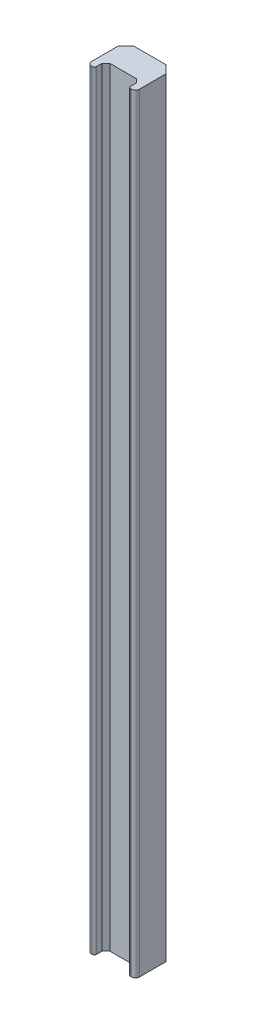
ISO-10303-21;
HEADER;
FILE_DESCRIPTION(('STEP AP214'),'2;1');
FILE_NAME('part.step','',(''),(''),'','','');
FILE_SCHEMA(('AUTOMOTIVE_DESIGN { 1 0 10303 214 1 1 1 1 }'));
ENDSEC;
DATA;
#1=APPLICATION_CONTEXT('core data for automotive mechanical design processes');
#2=APPLICATION_PROTOCOL_DEFINITION('international standard','automotive_design',2000,#1);
#3=PRODUCT_CONTEXT('',#1,'mechanical');
#4=PRODUCT('Part','Part','',(#3));
#5=PRODUCT_RELATED_PRODUCT_CATEGORY('part','',(#4));
#6=PRODUCT_DEFINITION_FORMATION('','',#4);
#7=PRODUCT_DEFINITION_CONTEXT('part definition',#1,'design');
#8=PRODUCT_DEFINITION('design','',#6,#7);
#9=PRODUCT_DEFINITION_SHAPE('','',#8);
#10=(LENGTH_UNIT() NAMED_UNIT(*) SI_UNIT(.MILLI.,.METRE.));
#11=(NAMED_UNIT(*) PLANE_ANGLE_UNIT() SI_UNIT($,.RADIAN.));
#12=(NAMED_UNIT(*) SI_UNIT($,.STERADIAN.) SOLID_ANGLE_UNIT());
#13=UNCERTAINTY_MEASURE_WITH_UNIT(LENGTH_MEASURE(1.E-05),#10,'distance_accuracy_value','');
#14=(GEOMETRIC_REPRESENTATION_CONTEXT(3) GLOBAL_UNCERTAINTY_ASSIGNED_CONTEXT((#13)) GLOBAL_UNIT_ASSIGNED_CONTEXT((#10,
#11,#12)) REPRESENTATION_CONTEXT('',''));
#15=CARTESIAN_POINT('',(0.,0.,0.));
#16=DIRECTION('',(0.,0.,1.));
#17=DIRECTION('',(1.,0.,0.));
#18=AXIS2_PLACEMENT_3D('',#15,#16,#17);
#19=CARTESIAN_POINT('',(1.,200.,0.));
#20=DIRECTION('',(0.,0.,-1.));
#21=DIRECTION('',(-1.,0.,0.));
#22=AXIS2_PLACEMENT_3D('',#19,#20,#21);
#23=PLANE('',#22);
#24=DIRECTION('',(1.,0.,0.));
#25=VECTOR('',#24,1.);
#26=CARTESIAN_POINT('',(1.,200.,0.));
#27=LINE('',#26,#25);
#28=CARTESIAN_POINT('',(11.19,200.,0.));
#29=VERTEX_POINT('',#28);
#30=CARTESIAN_POINT('',(11.48,200.,0.));
#31=VERTEX_POINT('',#30);
#32=EDGE_CURVE('E303',#29,#31,#27,.T.);
#33=ORIENTED_EDGE('',*,*,#32,.F.);
#34=DIRECTION('',(0.,-1.,0.));
#35=VECTOR('',#34,1.);
#36=CARTESIAN_POINT('',(11.19,200.,0.));
#37=LINE('',#36,#35);
#38=CARTESIAN_POINT('',(11.19,0.,0.));
#39=VERTEX_POINT('',#38);
#40=EDGE_CURVE('E370',#29,#39,#37,.T.);
#41=ORIENTED_EDGE('',*,*,#40,.T.);
#42=DIRECTION('',(1.,0.,0.));
#43=VECTOR('',#42,1.);
#44=CARTESIAN_POINT('',(1.,0.,0.));
#45=LINE('',#44,#43);
#46=CARTESIAN_POINT('',(11.48,0.,0.));
#47=VERTEX_POINT('',#46);
#48=EDGE_CURVE('E325',#39,#47,#45,.T.);
#49=ORIENTED_EDGE('',*,*,#48,.T.);
#50=DIRECTION('',(0.,-1.,0.));
#51=VECTOR('',#50,1.);
#52=CARTESIAN_POINT('',(11.48,200.,0.));
#53=LINE('',#52,#51);
#54=EDGE_CURVE('E306',#31,#47,#53,.T.);
#55=ORIENTED_EDGE('',*,*,#54,.F.);
#56=EDGE_LOOP('',(#33,#41,#49,#55));
#57=FACE_BOUND('',#56,.T.);
#58=ADVANCED_FACE('F38',(#57),#23,.F.);
#59=CARTESIAN_POINT('',(10.48,200.,-10.));
#60=DIRECTION('',(-0.707106781186547,0.,0.707106781186547));
#61=DIRECTION('',(0.707106781186548,0.,0.707106781186548));
#62=AXIS2_PLACEMENT_3D('',#59,#60,#61);
#63=PLANE('',#62);
#64=DIRECTION('',(0.,-1.,0.));
#65=VECTOR('',#64,1.);
#66=CARTESIAN_POINT('',(12.48,200.,-8.));
#67=LINE('',#66,#65);
#68=CARTESIAN_POINT('',(12.48,200.,-8.));
#69=VERTEX_POINT('',#68);
#70=CARTESIAN_POINT('',(12.48,175.,-8.));
#71=VERTEX_POINT('',#70);
#72=EDGE_CURVE('E351',#69,#71,#67,.T.);
#73=ORIENTED_EDGE('',*,*,#72,.T.);
#74=DIRECTION('',(-0.707106781186548,0.,-0.707106781186548));
#75=VECTOR('',#74,1.);
#76=CARTESIAN_POINT('',(10.48,175.,-10.));
#77=LINE('',#76,#75);
#78=CARTESIAN_POINT('',(10.48,175.,-10.));
#79=VERTEX_POINT('',#78);
#80=EDGE_CURVE('E283',#71,#79,#77,.T.);
#81=ORIENTED_EDGE('',*,*,#80,.T.);
#82=DIRECTION('',(0.,-1.,0.));
#83=VECTOR('',#82,1.);
#84=CARTESIAN_POINT('',(10.48,200.,-10.));
#85=LINE('',#84,#83);
#86=CARTESIAN_POINT('',(10.48,200.,-10.));
#87=VERTEX_POINT('',#86);
#88=EDGE_CURVE('E346',#87,#79,#85,.T.);
#89=ORIENTED_EDGE('',*,*,#88,.F.);
#90=DIRECTION('',(-0.707106781186547,0.,-0.707106781186547));
#91=VECTOR('',#90,1.);
#92=CARTESIAN_POINT('',(10.48,200.,-10.));
#93=LINE('',#92,#91);
#94=EDGE_CURVE('E293',#69,#87,#93,.T.);
#95=ORIENTED_EDGE('',*,*,#94,.F.);
#96=EDGE_LOOP('',(#73,#81,#89,#95));
#97=FACE_BOUND('',#96,.T.);
#98=ADVANCED_FACE('F418',(#97),#63,.F.);
#99=CARTESIAN_POINT('',(10.48,169.,-10.));
#100=VERTEX_POINT('',#99);
#101=CARTESIAN_POINT('',(10.48,31.,-10.));
#102=VERTEX_POINT('',#101);
#103=EDGE_CURVE('E350',#100,#102,#85,.T.);
#104=ORIENTED_EDGE('',*,*,#103,.F.);
#105=DIRECTION('',(0.707106781186548,0.,0.707106781186548));
#106=VECTOR('',#105,1.);
#107=CARTESIAN_POINT('',(10.48,169.,-10.));
#108=LINE('',#107,#106);
#109=CARTESIAN_POINT('',(12.48,169.,-8.));
#110=VERTEX_POINT('',#109);
#111=EDGE_CURVE('E280',#100,#110,#108,.T.);
#112=ORIENTED_EDGE('',*,*,#111,.T.);
#113=CARTESIAN_POINT('',(12.48,31.,-8.));
#114=VERTEX_POINT('',#113);
#115=EDGE_CURVE('E355',#110,#114,#67,.T.);
#116=ORIENTED_EDGE('',*,*,#115,.T.);
#117=DIRECTION('',(-0.707106781186548,0.,-0.707106781186548));
#118=VECTOR('',#117,1.);
#119=CARTESIAN_POINT('',(10.48,31.,-10.));
#120=LINE('',#119,#118);
#121=EDGE_CURVE('E277',#114,#102,#120,.T.);
#122=ORIENTED_EDGE('',*,*,#121,.T.);
#123=EDGE_LOOP('',(#104,#112,#116,#122));
#124=FACE_BOUND('',#123,.T.);
#125=ADVANCED_FACE('F449',(#124),#63,.F.);
#126=CARTESIAN_POINT('',(2.,200.,-10.));
#127=DIRECTION('',(0.,0.,1.));
#128=DIRECTION('',(1.,0.,0.));
#129=AXIS2_PLACEMENT_3D('',#126,#127,#128);
#130=PLANE('',#129);
#131=ORIENTED_EDGE('',*,*,#88,.T.);
#132=DIRECTION('',(1.,0.,0.));
#133=VECTOR('',#132,1.);
#134=CARTESIAN_POINT('',(12.48,175.,-10.));
#135=LINE('',#134,#133);
#136=CARTESIAN_POINT('',(2.,175.,-10.));
#137=VERTEX_POINT('',#136);
#138=EDGE_CURVE('E251',#137,#79,#135,.T.);
#139=ORIENTED_EDGE('',*,*,#138,.F.);
#140=DIRECTION('',(0.,-1.,0.));
#141=VECTOR('',#140,1.);
#142=CARTESIAN_POINT('',(2.,200.,-10.));
#143=LINE('',#142,#141);
#144=CARTESIAN_POINT('',(2.,200.,-10.));
#145=VERTEX_POINT('',#144);
#146=EDGE_CURVE('E341',#145,#137,#143,.T.);
#147=ORIENTED_EDGE('',*,*,#146,.F.);
#148=DIRECTION('',(-1.,0.,0.));
#149=VECTOR('',#148,1.);
#150=CARTESIAN_POINT('',(2.,200.,-10.));
#151=LINE('',#150,#149);
#152=EDGE_CURVE('E295',#87,#145,#151,.T.);
#153=ORIENTED_EDGE('',*,*,#152,.F.);
#154=EDGE_LOOP('',(#131,#139,#147,#153));
#155=FACE_BOUND('',#154,.T.);
#156=ADVANCED_FACE('F423',(#155),#130,.F.);
#157=CARTESIAN_POINT('',(2.,169.,-10.));
#158=VERTEX_POINT('',#157);
#159=CARTESIAN_POINT('',(2.,31.,-10.));
#160=VERTEX_POINT('',#159);
#161=EDGE_CURVE('E345',#158,#160,#143,.T.);
#162=ORIENTED_EDGE('',*,*,#161,.F.);
#163=DIRECTION('',(-1.,0.,0.));
#164=VECTOR('',#163,1.);
#165=CARTESIAN_POINT('',(12.48,169.,-10.));
#166=LINE('',#165,#164);
#167=EDGE_CURVE('E259',#100,#158,#166,.T.);
#168=ORIENTED_EDGE('',*,*,#167,.F.);
#169=ORIENTED_EDGE('',*,*,#103,.T.);
#170=DIRECTION('',(1.,0.,0.));
#171=VECTOR('',#170,1.);
#172=CARTESIAN_POINT('',(12.48,31.,-10.));
#173=LINE('',#172,#171);
#174=EDGE_CURVE('E267',#160,#102,#173,.T.);
#175=ORIENTED_EDGE('',*,*,#174,.F.);
#176=EDGE_LOOP('',(#162,#168,#169,#175));
#177=FACE_BOUND('',#176,.T.);
#178=ADVANCED_FACE('F486',(#177),#130,.F.);
#179=CARTESIAN_POINT('',(0.,200.,-8.));
#180=DIRECTION('',(0.707106781186548,0.,0.707106781186547));
#181=DIRECTION('',(0.707106781186547,0.,-0.707106781186548));
#182=AXIS2_PLACEMENT_3D('',#179,#180,#181);
#183=PLANE('',#182);
#184=ORIENTED_EDGE('',*,*,#146,.T.);
#185=DIRECTION('',(-0.707106781186547,0.,0.707106781186548));
#186=VECTOR('',#185,1.);
#187=CARTESIAN_POINT('',(0.,175.,-8.));
#188=LINE('',#187,#186);
#189=CARTESIAN_POINT('',(0.,175.,-8.));
#190=VERTEX_POINT('',#189);
#191=EDGE_CURVE('E367',#137,#190,#188,.T.);
#192=ORIENTED_EDGE('',*,*,#191,.T.);
#193=DIRECTION('',(0.,-1.,0.));
#194=VECTOR('',#193,1.);
#195=CARTESIAN_POINT('',(0.,200.,-8.));
#196=LINE('',#195,#194);
#197=CARTESIAN_POINT('',(0.,200.,-8.));
#198=VERTEX_POINT('',#197);
#199=EDGE_CURVE('E336',#198,#190,#196,.T.);
#200=ORIENTED_EDGE('',*,*,#199,.F.);
#201=DIRECTION('',(-0.707106781186547,0.,0.707106781186548));
#202=VECTOR('',#201,1.);
#203=CARTESIAN_POINT('',(0.,200.,-8.));
#204=LINE('',#203,#202);
#205=EDGE_CURVE('E297',#145,#198,#204,.T.);
#206=ORIENTED_EDGE('',*,*,#205,.F.);
#207=EDGE_LOOP('',(#184,#192,#200,#206));
#208=FACE_BOUND('',#207,.T.);
#209=ADVANCED_FACE('F429',(#208),#183,.F.);
#210=CARTESIAN_POINT('',(0.,169.,-8.));
#211=VERTEX_POINT('',#210);
#212=CARTESIAN_POINT('',(0.,31.,-8.));
#213=VERTEX_POINT('',#212);
#214=EDGE_CURVE('E340',#211,#213,#196,.T.);
#215=ORIENTED_EDGE('',*,*,#214,.F.);
#216=DIRECTION('',(0.707106781186547,0.,-0.707106781186548));
#217=VECTOR('',#216,1.);
#218=CARTESIAN_POINT('',(0.,169.,-8.));
#219=LINE('',#218,#217);
#220=EDGE_CURVE('E364',#211,#158,#219,.T.);
#221=ORIENTED_EDGE('',*,*,#220,.T.);
#222=ORIENTED_EDGE('',*,*,#161,.T.);
#223=DIRECTION('',(-0.707106781186547,0.,0.707106781186548));
#224=VECTOR('',#223,1.);
#225=CARTESIAN_POINT('',(0.,31.,-8.));
#226=LINE('',#225,#224);
#227=EDGE_CURVE('E361',#160,#213,#226,.T.);
#228=ORIENTED_EDGE('',*,*,#227,.T.);
#229=EDGE_LOOP('',(#215,#221,#222,#228));
#230=FACE_BOUND('',#229,.T.);
#231=ADVANCED_FACE('F491',(#230),#183,.F.);
#232=CARTESIAN_POINT('',(11.48,200.,-1.));
#233=DIRECTION('',(0.,-1.,0.));
#234=DIRECTION('',(0.,0.,-1.));
#235=AXIS2_PLACEMENT_3D('',#232,#233,#234);
#236=CYLINDRICAL_SURFACE('',#235,1.);
#237=CARTESIAN_POINT('',(11.48,0.,-1.));
#238=DIRECTION('',(0.,1.,0.));
#239=DIRECTION('',(0.,0.,1.));
#240=AXIS2_PLACEMENT_3D('',#237,#238,#239);
#241=CIRCLE('',#240,1.);
#242=CARTESIAN_POINT('',(12.48,0.,-1.));
#243=VERTEX_POINT('',#242);
#244=EDGE_CURVE('E286',#47,#243,#241,.T.);
#245=ORIENTED_EDGE('',*,*,#244,.T.);
#246=DIRECTION('',(0.,-1.,0.));
#247=VECTOR('',#246,1.);
#248=CARTESIAN_POINT('',(12.48,200.,-1.));
#249=LINE('',#248,#247);
#250=CARTESIAN_POINT('',(12.48,200.,-1.));
#251=VERTEX_POINT('',#250);
#252=EDGE_CURVE('E354',#251,#243,#249,.T.);
#253=ORIENTED_EDGE('',*,*,#252,.F.);
#254=CARTESIAN_POINT('',(11.48,200.,-1.));
#255=DIRECTION('',(0.,1.,0.));
#256=DIRECTION('',(0.,0.,1.));
#257=AXIS2_PLACEMENT_3D('',#254,#255,#256);
#258=CIRCLE('',#257,1.);
#259=EDGE_CURVE('E287',#31,#251,#258,.T.);
#260=ORIENTED_EDGE('',*,*,#259,.F.);
#261=ORIENTED_EDGE('',*,*,#54,.T.);
#262=EDGE_LOOP('',(#245,#253,#260,#261));
#263=FACE_BOUND('',#262,.T.);
#264=ADVANCED_FACE('F409',(#263),#236,.T.);
#265=CARTESIAN_POINT('',(12.48,200.,-1.));
#266=DIRECTION('',(-1.,0.,0.));
#267=DIRECTION('',(0.,0.,1.));
#268=AXIS2_PLACEMENT_3D('',#265,#266,#267);
#269=PLANE('',#268);
#270=DIRECTION('',(0.,0.,-1.));
#271=VECTOR('',#270,1.);
#272=CARTESIAN_POINT('',(12.48,0.,-1.));
#273=LINE('',#272,#271);
#274=CARTESIAN_POINT('',(12.48,0.,-8.));
#275=VERTEX_POINT('',#274);
#276=EDGE_CURVE('E309',#243,#275,#273,.T.);
#277=ORIENTED_EDGE('',*,*,#276,.T.);
#278=CARTESIAN_POINT('',(12.48,25.,-8.));
#279=VERTEX_POINT('',#278);
#280=EDGE_CURVE('E349',#279,#275,#67,.T.);
#281=ORIENTED_EDGE('',*,*,#280,.F.);
#282=DIRECTION('',(0.,-1.,0.));
#283=VECTOR('',#282,1.);
#284=CARTESIAN_POINT('',(12.48,25.,-8.));
#285=LINE('',#284,#283);
#286=EDGE_CURVE('E263',#114,#279,#285,.T.);
#287=ORIENTED_EDGE('',*,*,#286,.F.);
#288=ORIENTED_EDGE('',*,*,#115,.F.);
#289=DIRECTION('',(0.,-1.,0.));
#290=VECTOR('',#289,1.);
#291=CARTESIAN_POINT('',(12.48,175.,-8.));
#292=LINE('',#291,#290);
#293=EDGE_CURVE('E247',#71,#110,#292,.T.);
#294=ORIENTED_EDGE('',*,*,#293,.F.);
#295=ORIENTED_EDGE('',*,*,#72,.F.);
#296=DIRECTION('',(0.,0.,-1.));
#297=VECTOR('',#296,1.);
#298=CARTESIAN_POINT('',(12.48,200.,-1.));
#299=LINE('',#298,#297);
#300=EDGE_CURVE('E290',#251,#69,#299,.T.);
#301=ORIENTED_EDGE('',*,*,#300,.F.);
#302=ORIENTED_EDGE('',*,*,#252,.T.);
#303=EDGE_LOOP('',(#277,#281,#287,#288,#294,#295,#301,#302));
#304=FACE_BOUND('',#303,.T.);
#305=ADVANCED_FACE('F415',(#304),#269,.F.);
#306=CARTESIAN_POINT('',(10.48,25.,-10.));
#307=VERTEX_POINT('',#306);
#308=CARTESIAN_POINT('',(10.48,0.,-10.));
#309=VERTEX_POINT('',#308);
#310=EDGE_CURVE('E344',#307,#309,#85,.T.);
#311=ORIENTED_EDGE('',*,*,#310,.F.);
#312=DIRECTION('',(0.707106781186548,0.,0.707106781186548));
#313=VECTOR('',#312,1.);
#314=CARTESIAN_POINT('',(10.48,25.,-10.));
#315=LINE('',#314,#313);
#316=EDGE_CURVE('E258',#307,#279,#315,.T.);
#317=ORIENTED_EDGE('',*,*,#316,.T.);
#318=ORIENTED_EDGE('',*,*,#280,.T.);
#319=DIRECTION('',(-0.707106781186547,0.,-0.707106781186547));
#320=VECTOR('',#319,1.);
#321=CARTESIAN_POINT('',(10.48,0.,-10.));
#322=LINE('',#321,#320);
#323=EDGE_CURVE('E312',#275,#309,#322,.T.);
#324=ORIENTED_EDGE('',*,*,#323,.T.);
#325=EDGE_LOOP('',(#311,#317,#318,#324));
#326=FACE_BOUND('',#325,.T.);
#327=ADVANCED_FACE('F451',(#326),#63,.F.);
#328=CARTESIAN_POINT('',(2.,25.,-10.));
#329=VERTEX_POINT('',#328);
#330=CARTESIAN_POINT('',(2.,0.,-10.));
#331=VERTEX_POINT('',#330);
#332=EDGE_CURVE('E339',#329,#331,#143,.T.);
#333=ORIENTED_EDGE('',*,*,#332,.F.);
#334=DIRECTION('',(-1.,0.,0.));
#335=VECTOR('',#334,1.);
#336=CARTESIAN_POINT('',(12.48,25.,-10.));
#337=LINE('',#336,#335);
#338=EDGE_CURVE('E243',#307,#329,#337,.T.);
#339=ORIENTED_EDGE('',*,*,#338,.F.);
#340=ORIENTED_EDGE('',*,*,#310,.T.);
#341=DIRECTION('',(-1.,0.,0.));
#342=VECTOR('',#341,1.);
#343=CARTESIAN_POINT('',(2.,0.,-10.));
#344=LINE('',#343,#342);
#345=EDGE_CURVE('E315',#309,#331,#344,.T.);
#346=ORIENTED_EDGE('',*,*,#345,.T.);
#347=EDGE_LOOP('',(#333,#339,#340,#346));
#348=FACE_BOUND('',#347,.T.);
#349=ADVANCED_FACE('F471',(#348),#130,.F.);
#350=CARTESIAN_POINT('',(0.,25.,-8.));
#351=VERTEX_POINT('',#350);
#352=CARTESIAN_POINT('',(0.,0.,-8.));
#353=VERTEX_POINT('',#352);
#354=EDGE_CURVE('E335',#351,#353,#196,.T.);
#355=ORIENTED_EDGE('',*,*,#354,.F.);
#356=DIRECTION('',(0.707106781186547,0.,-0.707106781186548));
#357=VECTOR('',#356,1.);
#358=CARTESIAN_POINT('',(0.,25.,-8.));
#359=LINE('',#358,#357);
#360=EDGE_CURVE('E358',#351,#329,#359,.T.);
#361=ORIENTED_EDGE('',*,*,#360,.T.);
#362=ORIENTED_EDGE('',*,*,#332,.T.);
#363=DIRECTION('',(-0.707106781186547,0.,0.707106781186548));
#364=VECTOR('',#363,1.);
#365=CARTESIAN_POINT('',(0.,0.,-8.));
#366=LINE('',#365,#364);
#367=EDGE_CURVE('E318',#331,#353,#366,.T.);
#368=ORIENTED_EDGE('',*,*,#367,.T.);
#369=EDGE_LOOP('',(#355,#361,#362,#368));
#370=FACE_BOUND('',#369,.T.);
#371=ADVANCED_FACE('F465',(#370),#183,.F.);
#372=CARTESIAN_POINT('',(0.,200.,-1.));
#373=DIRECTION('',(1.,0.,0.));
#374=DIRECTION('',(0.,0.,-1.));
#375=AXIS2_PLACEMENT_3D('',#372,#373,#374);
#376=PLANE('',#375);
#377=DIRECTION('',(0.,0.,1.));
#378=VECTOR('',#377,1.);
#379=CARTESIAN_POINT('',(0.,0.,-1.));
#380=LINE('',#379,#378);
#381=CARTESIAN_POINT('',(0.,0.,-1.));
#382=VERTEX_POINT('',#381);
#383=EDGE_CURVE('E321',#353,#382,#380,.T.);
#384=ORIENTED_EDGE('',*,*,#383,.T.);
#385=DIRECTION('',(0.,-1.,0.));
#386=VECTOR('',#385,1.);
#387=CARTESIAN_POINT('',(0.,200.,-1.));
#388=LINE('',#387,#386);
#389=CARTESIAN_POINT('',(0.,200.,-1.));
#390=VERTEX_POINT('',#389);
#391=EDGE_CURVE('E332',#390,#382,#388,.T.);
#392=ORIENTED_EDGE('',*,*,#391,.F.);
#393=DIRECTION('',(0.,0.,1.));
#394=VECTOR('',#393,1.);
#395=CARTESIAN_POINT('',(0.,200.,-1.));
#396=LINE('',#395,#394);
#397=EDGE_CURVE('E299',#198,#390,#396,.T.);
#398=ORIENTED_EDGE('',*,*,#397,.F.);
#399=ORIENTED_EDGE('',*,*,#199,.T.);
#400=DIRECTION('',(0.,1.,0.));
#401=VECTOR('',#400,1.);
#402=CARTESIAN_POINT('',(0.,175.,-8.));
#403=LINE('',#402,#401);
#404=EDGE_CURVE('E253',#211,#190,#403,.T.);
#405=ORIENTED_EDGE('',*,*,#404,.F.);
#406=ORIENTED_EDGE('',*,*,#214,.T.);
#407=DIRECTION('',(0.,1.,0.));
#408=VECTOR('',#407,1.);
#409=CARTESIAN_POINT('',(0.,25.,-8.));
#410=LINE('',#409,#408);
#411=EDGE_CURVE('E269',#351,#213,#410,.T.);
#412=ORIENTED_EDGE('',*,*,#411,.F.);
#413=ORIENTED_EDGE('',*,*,#354,.T.);
#414=EDGE_LOOP('',(#384,#392,#398,#399,#405,#406,#412,#413));
#415=FACE_BOUND('',#414,.T.);
#416=ADVANCED_FACE('F432',(#415),#376,.F.);
#417=CARTESIAN_POINT('',(1.,200.,-1.));
#418=DIRECTION('',(0.,-1.,0.));
#419=DIRECTION('',(0.,0.,-1.));
#420=AXIS2_PLACEMENT_3D('',#417,#418,#419);
#421=CYLINDRICAL_SURFACE('',#420,1.);
#422=CARTESIAN_POINT('',(1.,0.,-1.));
#423=DIRECTION('',(0.,1.,0.));
#424=DIRECTION('',(0.,0.,-1.));
#425=AXIS2_PLACEMENT_3D('',#422,#423,#424);
#426=CIRCLE('',#425,1.);
#427=CARTESIAN_POINT('',(1.,0.,0.));
#428=VERTEX_POINT('',#427);
#429=EDGE_CURVE('E323',#382,#428,#426,.T.);
#430=ORIENTED_EDGE('',*,*,#429,.T.);
#431=DIRECTION('',(0.,-1.,0.));
#432=VECTOR('',#431,1.);
#433=CARTESIAN_POINT('',(1.,200.,0.));
#434=LINE('',#433,#432);
#435=CARTESIAN_POINT('',(1.,200.,0.));
#436=VERTEX_POINT('',#435);
#437=EDGE_CURVE('E329',#436,#428,#434,.T.);
#438=ORIENTED_EDGE('',*,*,#437,.F.);
#439=CARTESIAN_POINT('',(1.,200.,-1.));
#440=DIRECTION('',(0.,1.,0.));
#441=DIRECTION('',(0.,0.,-1.));
#442=AXIS2_PLACEMENT_3D('',#439,#440,#441);
#443=CIRCLE('',#442,1.);
#444=EDGE_CURVE('E301',#390,#436,#443,.T.);
#445=ORIENTED_EDGE('',*,*,#444,.F.);
#446=ORIENTED_EDGE('',*,*,#391,.T.);
#447=EDGE_LOOP('',(#430,#438,#445,#446));
#448=FACE_BOUND('',#447,.T.);
#449=ADVANCED_FACE('F438',(#448),#421,.T.);
#450=CARTESIAN_POINT('',(1.29000000000001,0.,0.));
#451=VERTEX_POINT('',#450);
#452=EDGE_CURVE('E291',#428,#451,#45,.T.);
#453=ORIENTED_EDGE('',*,*,#452,.T.);
#454=DIRECTION('',(0.,-1.,0.));
#455=VECTOR('',#454,1.);
#456=CARTESIAN_POINT('',(1.29000000000001,200.,0.));
#457=LINE('',#456,#455);
#458=CARTESIAN_POINT('',(1.29000000000001,200.,0.));
#459=VERTEX_POINT('',#458);
#460=EDGE_CURVE('E11',#451,#459,#457,.F.);
#461=ORIENTED_EDGE('',*,*,#460,.T.);
#462=EDGE_CURVE('E304',#436,#459,#27,.T.);
#463=ORIENTED_EDGE('',*,*,#462,.F.);
#464=ORIENTED_EDGE('',*,*,#437,.T.);
#465=EDGE_LOOP('',(#453,#461,#463,#464));
#466=FACE_BOUND('',#465,.T.);
#467=ADVANCED_FACE('F445',(#466),#23,.F.);
#468=CARTESIAN_POINT('',(11.48,200.,-1.));
#469=DIRECTION('',(0.,1.,0.));
#470=DIRECTION('',(0.,0.,1.));
#471=AXIS2_PLACEMENT_3D('',#468,#469,#470);
#472=PLANE('',#471);
#473=DIRECTION('',(0.,0.,1.));
#474=VECTOR('',#473,1.);
#475=CARTESIAN_POINT('',(10.69,200.,-2.));
#476=LINE('',#475,#474);
#477=CARTESIAN_POINT('',(10.69,200.,-2.));
#478=VERTEX_POINT('',#477);
#479=CARTESIAN_POINT('',(10.69,200.,-0.5));
#480=VERTEX_POINT('',#479);
#481=EDGE_CURVE('E218',#478,#480,#476,.T.);
#482=ORIENTED_EDGE('',*,*,#481,.T.);
#483=CARTESIAN_POINT('',(11.19,200.,-0.5));
#484=DIRECTION('',(0.,1.,0.));
#485=DIRECTION('',(0.,0.,1.));
#486=AXIS2_PLACEMENT_3D('',#483,#484,#485);
#487=CIRCLE('',#486,0.5);
#488=EDGE_CURVE('E380',#480,#29,#487,.T.);
#489=ORIENTED_EDGE('',*,*,#488,.T.);
#490=ORIENTED_EDGE('',*,*,#32,.T.);
#491=ORIENTED_EDGE('',*,*,#259,.T.);
#492=ORIENTED_EDGE('',*,*,#300,.T.);
#493=ORIENTED_EDGE('',*,*,#94,.T.);
#494=ORIENTED_EDGE('',*,*,#152,.T.);
#495=ORIENTED_EDGE('',*,*,#205,.T.);
#496=ORIENTED_EDGE('',*,*,#397,.T.);
#497=ORIENTED_EDGE('',*,*,#444,.T.);
#498=ORIENTED_EDGE('',*,*,#462,.T.);
#499=CARTESIAN_POINT('',(1.29000000000001,200.,-0.5));
#500=DIRECTION('',(0.,1.,0.));
#501=DIRECTION('',(0.,0.,1.));
#502=AXIS2_PLACEMENT_3D('',#499,#500,#501);
#503=CIRCLE('',#502,0.5);
#504=CARTESIAN_POINT('',(1.79000000000001,200.,-0.5));
#505=VERTEX_POINT('',#504);
#506=EDGE_CURVE('E53',#459,#505,#503,.T.);
#507=ORIENTED_EDGE('',*,*,#506,.T.);
#508=DIRECTION('',(0.,0.,-1.));
#509=VECTOR('',#508,1.);
#510=CARTESIAN_POINT('',(1.79000000000001,200.,0.));
#511=LINE('',#510,#509);
#512=CARTESIAN_POINT('',(1.79000000000001,200.,-2.));
#513=VERTEX_POINT('',#512);
#514=EDGE_CURVE('E197',#505,#513,#511,.T.);
#515=ORIENTED_EDGE('',*,*,#514,.T.);
#516=DIRECTION('',(0.707106781186548,0.,-0.707106781186547));
#517=VECTOR('',#516,1.);
#518=CARTESIAN_POINT('',(1.79000000000001,200.,-2.));
#519=LINE('',#518,#517);
#520=CARTESIAN_POINT('',(2.79000000000001,200.,-3.));
#521=VERTEX_POINT('',#520);
#522=EDGE_CURVE('E203',#513,#521,#519,.T.);
#523=ORIENTED_EDGE('',*,*,#522,.T.);
#524=DIRECTION('',(1.,0.,0.));
#525=VECTOR('',#524,1.);
#526=CARTESIAN_POINT('',(9.69000000000001,200.,-3.));
#527=LINE('',#526,#525);
#528=CARTESIAN_POINT('',(9.69000000000001,200.,-3.));
#529=VERTEX_POINT('',#528);
#530=EDGE_CURVE('E222',#521,#529,#527,.T.);
#531=ORIENTED_EDGE('',*,*,#530,.T.);
#532=DIRECTION('',(0.707106781186547,0.,0.707106781186547));
#533=VECTOR('',#532,1.);
#534=CARTESIAN_POINT('',(10.69,200.,-2.));
#535=LINE('',#534,#533);
#536=EDGE_CURVE('E224',#529,#478,#535,.T.);
#537=ORIENTED_EDGE('',*,*,#536,.T.);
#538=EDGE_LOOP('',(#482,#489,#490,#491,#492,#493,#494,#495,#496,#497,#498,#507,#515,#523,#531,#537));
#539=FACE_BOUND('',#538,.T.);
#540=ADVANCED_FACE('F200',(#539),#472,.T.);
#541=CARTESIAN_POINT('',(11.48,0.,-1.));
#542=DIRECTION('',(0.,1.,0.));
#543=DIRECTION('',(0.,0.,1.));
#544=AXIS2_PLACEMENT_3D('',#541,#542,#543);
#545=PLANE('',#544);
#546=ORIENTED_EDGE('',*,*,#48,.F.);
#547=CARTESIAN_POINT('',(11.19,0.,-0.5));
#548=DIRECTION('',(0.,1.,0.));
#549=DIRECTION('',(0.,0.,1.));
#550=AXIS2_PLACEMENT_3D('',#547,#548,#549);
#551=CIRCLE('',#550,0.5);
#552=CARTESIAN_POINT('',(10.69,0.,-0.5));
#553=VERTEX_POINT('',#552);
#554=EDGE_CURVE('E375',#39,#553,#551,.F.);
#555=ORIENTED_EDGE('',*,*,#554,.T.);
#556=DIRECTION('',(0.,0.,1.));
#557=VECTOR('',#556,1.);
#558=CARTESIAN_POINT('',(10.69,0.,-2.));
#559=LINE('',#558,#557);
#560=CARTESIAN_POINT('',(10.69,0.,-2.));
#561=VERTEX_POINT('',#560);
#562=EDGE_CURVE('E207',#561,#553,#559,.T.);
#563=ORIENTED_EDGE('',*,*,#562,.F.);
#564=DIRECTION('',(0.707106781186547,0.,0.707106781186547));
#565=VECTOR('',#564,1.);
#566=CARTESIAN_POINT('',(10.69,0.,-2.));
#567=LINE('',#566,#565);
#568=CARTESIAN_POINT('',(9.69000000000001,0.,-3.));
#569=VERTEX_POINT('',#568);
#570=EDGE_CURVE('E236',#569,#561,#567,.T.);
#571=ORIENTED_EDGE('',*,*,#570,.F.);
#572=DIRECTION('',(1.,0.,0.));
#573=VECTOR('',#572,1.);
#574=CARTESIAN_POINT('',(9.69000000000001,0.,-3.));
#575=LINE('',#574,#573);
#576=CARTESIAN_POINT('',(2.79000000000001,0.,-3.));
#577=VERTEX_POINT('',#576);
#578=EDGE_CURVE('E233',#577,#569,#575,.T.);
#579=ORIENTED_EDGE('',*,*,#578,.F.);
#580=DIRECTION('',(0.707106781186548,0.,-0.707106781186547));
#581=VECTOR('',#580,1.);
#582=CARTESIAN_POINT('',(1.79000000000001,0.,-2.));
#583=LINE('',#582,#581);
#584=CARTESIAN_POINT('',(1.79000000000001,0.,-2.));
#585=VERTEX_POINT('',#584);
#586=EDGE_CURVE('E231',#585,#577,#583,.T.);
#587=ORIENTED_EDGE('',*,*,#586,.F.);
#588=DIRECTION('',(0.,0.,-1.));
#589=VECTOR('',#588,1.);
#590=CARTESIAN_POINT('',(1.79000000000001,0.,0.));
#591=LINE('',#590,#589);
#592=CARTESIAN_POINT('',(1.79000000000001,0.,-0.5));
#593=VERTEX_POINT('',#592);
#594=EDGE_CURVE('E213',#593,#585,#591,.T.);
#595=ORIENTED_EDGE('',*,*,#594,.F.);
#596=CARTESIAN_POINT('',(1.29000000000001,0.,-0.5));
#597=DIRECTION('',(0.,1.,0.));
#598=DIRECTION('',(0.,0.,1.));
#599=AXIS2_PLACEMENT_3D('',#596,#597,#598);
#600=CIRCLE('',#599,0.5);
#601=EDGE_CURVE('E373',#593,#451,#600,.F.);
#602=ORIENTED_EDGE('',*,*,#601,.T.);
#603=ORIENTED_EDGE('',*,*,#452,.F.);
#604=ORIENTED_EDGE('',*,*,#429,.F.);
#605=ORIENTED_EDGE('',*,*,#383,.F.);
#606=ORIENTED_EDGE('',*,*,#367,.F.);
#607=ORIENTED_EDGE('',*,*,#345,.F.);
#608=ORIENTED_EDGE('',*,*,#323,.F.);
#609=ORIENTED_EDGE('',*,*,#276,.F.);
#610=ORIENTED_EDGE('',*,*,#244,.F.);
#611=EDGE_LOOP('',(#546,#555,#563,#571,#579,#587,#595,#602,#603,#604,#605,#606,#607,#608,#609,#610));
#612=FACE_BOUND('',#611,.T.);
#613=ADVANCED_FACE('F384',(#612),#545,.F.);
#614=CARTESIAN_POINT('',(12.48,31.,-8.));
#615=DIRECTION('',(0.,1.,0.));
#616=DIRECTION('',(0.,0.,1.));
#617=AXIS2_PLACEMENT_3D('',#614,#615,#616);
#618=PLANE('',#617);
#619=DIRECTION('',(1.,0.,0.));
#620=VECTOR('',#619,1.);
#621=CARTESIAN_POINT('',(12.48,31.,-8.));
#622=LINE('',#621,#620);
#623=EDGE_CURVE('E261',#213,#114,#622,.T.);
#624=ORIENTED_EDGE('',*,*,#623,.F.);
#625=ORIENTED_EDGE('',*,*,#227,.F.);
#626=ORIENTED_EDGE('',*,*,#174,.T.);
#627=ORIENTED_EDGE('',*,*,#121,.F.);
#628=EDGE_LOOP('',(#624,#625,#626,#627));
#629=FACE_BOUND('',#628,.T.);
#630=ADVANCED_FACE('F512',(#629),#618,.F.);
#631=CARTESIAN_POINT('',(12.48,25.,-8.));
#632=DIRECTION('',(0.,-1.,0.));
#633=DIRECTION('',(0.,0.,-1.));
#634=AXIS2_PLACEMENT_3D('',#631,#632,#633);
#635=PLANE('',#634);
#636=ORIENTED_EDGE('',*,*,#338,.T.);
#637=ORIENTED_EDGE('',*,*,#360,.F.);
#638=DIRECTION('',(-1.,0.,0.));
#639=VECTOR('',#638,1.);
#640=CARTESIAN_POINT('',(12.48,25.,-8.));
#641=LINE('',#640,#639);
#642=EDGE_CURVE('E266',#279,#351,#641,.T.);
#643=ORIENTED_EDGE('',*,*,#642,.F.);
#644=ORIENTED_EDGE('',*,*,#316,.F.);
#645=EDGE_LOOP('',(#636,#637,#643,#644));
#646=FACE_BOUND('',#645,.T.);
#647=ADVANCED_FACE('F506',(#646),#635,.F.);
#648=CARTESIAN_POINT('',(0.,0.,-8.));
#649=DIRECTION('',(0.,0.,1.));
#650=DIRECTION('',(1.,0.,0.));
#651=AXIS2_PLACEMENT_3D('',#648,#649,#650);
#652=PLANE('',#651);
#653=ORIENTED_EDGE('',*,*,#286,.T.);
#654=ORIENTED_EDGE('',*,*,#642,.T.);
#655=ORIENTED_EDGE('',*,*,#411,.T.);
#656=ORIENTED_EDGE('',*,*,#623,.T.);
#657=EDGE_LOOP('',(#653,#654,#655,#656));
#658=FACE_BOUND('',#657,.T.);
#659=ADVANCED_FACE('F499',(#658),#652,.F.);
#660=CARTESIAN_POINT('',(12.48,175.,-8.));
#661=DIRECTION('',(0.,1.,0.));
#662=DIRECTION('',(0.,0.,1.));
#663=AXIS2_PLACEMENT_3D('',#660,#661,#662);
#664=PLANE('',#663);
#665=DIRECTION('',(1.,0.,0.));
#666=VECTOR('',#665,1.);
#667=CARTESIAN_POINT('',(12.48,175.,-8.));
#668=LINE('',#667,#666);
#669=EDGE_CURVE('E255',#190,#71,#668,.T.);
#670=ORIENTED_EDGE('',*,*,#669,.F.);
#671=ORIENTED_EDGE('',*,*,#191,.F.);
#672=ORIENTED_EDGE('',*,*,#138,.T.);
#673=ORIENTED_EDGE('',*,*,#80,.F.);
#674=EDGE_LOOP('',(#670,#671,#672,#673));
#675=FACE_BOUND('',#674,.T.);
#676=ADVANCED_FACE('F497',(#675),#664,.F.);
#677=CARTESIAN_POINT('',(12.48,169.,-8.));
#678=DIRECTION('',(0.,-1.,0.));
#679=DIRECTION('',(0.,0.,-1.));
#680=AXIS2_PLACEMENT_3D('',#677,#678,#679);
#681=PLANE('',#680);
#682=ORIENTED_EDGE('',*,*,#167,.T.);
#683=ORIENTED_EDGE('',*,*,#220,.F.);
#684=DIRECTION('',(-1.,0.,0.));
#685=VECTOR('',#684,1.);
#686=CARTESIAN_POINT('',(12.48,169.,-8.));
#687=LINE('',#686,#685);
#688=EDGE_CURVE('E250',#110,#211,#687,.T.);
#689=ORIENTED_EDGE('',*,*,#688,.F.);
#690=ORIENTED_EDGE('',*,*,#111,.F.);
#691=EDGE_LOOP('',(#682,#683,#689,#690));
#692=FACE_BOUND('',#691,.T.);
#693=ADVANCED_FACE('F482',(#692),#681,.F.);
#694=CARTESIAN_POINT('',(0.,0.,-8.));
#695=DIRECTION('',(0.,0.,-1.));
#696=DIRECTION('',(-1.,0.,0.));
#697=AXIS2_PLACEMENT_3D('',#694,#695,#696);
#698=PLANE('',#697);
#699=ORIENTED_EDGE('',*,*,#293,.T.);
#700=ORIENTED_EDGE('',*,*,#688,.T.);
#701=ORIENTED_EDGE('',*,*,#404,.T.);
#702=ORIENTED_EDGE('',*,*,#669,.T.);
#703=EDGE_LOOP('',(#699,#700,#701,#702));
#704=FACE_BOUND('',#703,.T.);
#705=ADVANCED_FACE('F495',(#704),#698,.T.);
#706=CARTESIAN_POINT('',(10.69,200.,-2.));
#707=DIRECTION('',(1.,0.,0.));
#708=DIRECTION('',(0.,0.,-1.));
#709=AXIS2_PLACEMENT_3D('',#706,#707,#708);
#710=PLANE('',#709);
#711=ORIENTED_EDGE('',*,*,#562,.T.);
#712=DIRECTION('',(0.,-1.,0.));
#713=VECTOR('',#712,1.);
#714=CARTESIAN_POINT('',(10.69,200.,-0.5));
#715=LINE('',#714,#713);
#716=EDGE_CURVE('E377',#553,#480,#715,.F.);
#717=ORIENTED_EDGE('',*,*,#716,.T.);
#718=ORIENTED_EDGE('',*,*,#481,.F.);
#719=DIRECTION('',(0.,-1.,0.));
#720=VECTOR('',#719,1.);
#721=CARTESIAN_POINT('',(10.69,200.,-2.));
#722=LINE('',#721,#720);
#723=EDGE_CURVE('E241',#478,#561,#722,.T.);
#724=ORIENTED_EDGE('',*,*,#723,.T.);
#725=EDGE_LOOP('',(#711,#717,#718,#724));
#726=FACE_BOUND('',#725,.T.);
#727=ADVANCED_FACE('F397',(#726),#710,.F.);
#728=CARTESIAN_POINT('',(10.69,200.,-2.));
#729=DIRECTION('',(0.707106781186547,0.,-0.707106781186547));
#730=DIRECTION('',(-0.707106781186548,0.,-0.707106781186548));
#731=AXIS2_PLACEMENT_3D('',#728,#729,#730);
#732=PLANE('',#731);
#733=ORIENTED_EDGE('',*,*,#570,.T.);
#734=ORIENTED_EDGE('',*,*,#723,.F.);
#735=ORIENTED_EDGE('',*,*,#536,.F.);
#736=DIRECTION('',(0.,-1.,0.));
#737=VECTOR('',#736,1.);
#738=CARTESIAN_POINT('',(9.69000000000001,200.,-3.));
#739=LINE('',#738,#737);
#740=EDGE_CURVE('E244',#529,#569,#739,.T.);
#741=ORIENTED_EDGE('',*,*,#740,.T.);
#742=EDGE_LOOP('',(#733,#734,#735,#741));
#743=FACE_BOUND('',#742,.T.);
#744=ADVANCED_FACE('F395',(#743),#732,.F.);
#745=CARTESIAN_POINT('',(9.69000000000001,200.,-3.));
#746=DIRECTION('',(0.,0.,-1.));
#747=DIRECTION('',(-1.,0.,0.));
#748=AXIS2_PLACEMENT_3D('',#745,#746,#747);
#749=PLANE('',#748);
#750=ORIENTED_EDGE('',*,*,#578,.T.);
#751=ORIENTED_EDGE('',*,*,#740,.F.);
#752=ORIENTED_EDGE('',*,*,#530,.F.);
#753=DIRECTION('',(0.,-1.,0.));
#754=VECTOR('',#753,1.);
#755=CARTESIAN_POINT('',(2.79000000000001,200.,-3.));
#756=LINE('',#755,#754);
#757=EDGE_CURVE('E217',#521,#577,#756,.T.);
#758=ORIENTED_EDGE('',*,*,#757,.T.);
#759=EDGE_LOOP('',(#750,#751,#752,#758));
#760=FACE_BOUND('',#759,.T.);
#761=ADVANCED_FACE('F390',(#760),#749,.F.);
#762=CARTESIAN_POINT('',(1.79000000000001,200.,-2.));
#763=DIRECTION('',(-0.707106781186547,0.,-0.707106781186548));
#764=DIRECTION('',(-0.707106781186548,0.,0.707106781186547));
#765=AXIS2_PLACEMENT_3D('',#762,#763,#764);
#766=PLANE('',#765);
#767=ORIENTED_EDGE('',*,*,#586,.T.);
#768=ORIENTED_EDGE('',*,*,#757,.F.);
#769=ORIENTED_EDGE('',*,*,#522,.F.);
#770=DIRECTION('',(0.,-1.,0.));
#771=VECTOR('',#770,1.);
#772=CARTESIAN_POINT('',(1.79000000000001,200.,-2.));
#773=LINE('',#772,#771);
#774=EDGE_CURVE('E210',#513,#585,#773,.T.);
#775=ORIENTED_EDGE('',*,*,#774,.T.);
#776=EDGE_LOOP('',(#767,#768,#769,#775));
#777=FACE_BOUND('',#776,.T.);
#778=ADVANCED_FACE('F220',(#777),#766,.F.);
#779=CARTESIAN_POINT('',(1.79000000000001,200.,0.));
#780=DIRECTION('',(-1.,0.,0.));
#781=DIRECTION('',(0.,0.,1.));
#782=AXIS2_PLACEMENT_3D('',#779,#780,#781);
#783=PLANE('',#782);
#784=ORIENTED_EDGE('',*,*,#514,.F.);
#785=DIRECTION('',(0.,-1.,0.));
#786=VECTOR('',#785,1.);
#787=CARTESIAN_POINT('',(1.79000000000001,200.,-0.5));
#788=LINE('',#787,#786);
#789=EDGE_CURVE('E46',#505,#593,#788,.T.);
#790=ORIENTED_EDGE('',*,*,#789,.T.);
#791=ORIENTED_EDGE('',*,*,#594,.T.);
#792=ORIENTED_EDGE('',*,*,#774,.F.);
#793=EDGE_LOOP('',(#784,#790,#791,#792));
#794=FACE_BOUND('',#793,.T.);
#795=ADVANCED_FACE('F211',(#794),#783,.F.);
#796=CARTESIAN_POINT('',(11.19,200.,-0.5));
#797=DIRECTION('',(0.,-1.,0.));
#798=DIRECTION('',(0.,0.,-1.));
#799=AXIS2_PLACEMENT_3D('',#796,#797,#798);
#800=CYLINDRICAL_SURFACE('',#799,0.5);
#801=ORIENTED_EDGE('',*,*,#488,.F.);
#802=ORIENTED_EDGE('',*,*,#716,.F.);
#803=ORIENTED_EDGE('',*,*,#554,.F.);
#804=ORIENTED_EDGE('',*,*,#40,.F.);
#805=EDGE_LOOP('',(#801,#802,#803,#804));
#806=FACE_BOUND('',#805,.T.);
#807=ADVANCED_FACE('F400',(#806),#800,.T.);
#808=CARTESIAN_POINT('',(1.29000000000001,200.,-0.5));
#809=DIRECTION('',(0.,-1.,0.));
#810=DIRECTION('',(0.,0.,-1.));
#811=AXIS2_PLACEMENT_3D('',#808,#809,#810);
#812=CYLINDRICAL_SURFACE('',#811,0.5);
#813=ORIENTED_EDGE('',*,*,#506,.F.);
#814=ORIENTED_EDGE('',*,*,#460,.F.);
#815=ORIENTED_EDGE('',*,*,#601,.F.);
#816=ORIENTED_EDGE('',*,*,#789,.F.);
#817=EDGE_LOOP('',(#813,#814,#815,#816));
#818=FACE_BOUND('',#817,.T.);
#819=ADVANCED_FACE('F40',(#818),#812,.T.);
#820=CLOSED_SHELL('',(#58,#98,#125,#156,#178,#209,#231,#264,#305,#327,#349,#371,#416,#449,#467,
#540,#613,#630,#647,#659,#676,#693,#705,#727,#744,#761,#778,#795,#807,#819));
#821=MANIFOLD_SOLID_BREP('B2',#820);
#822=ADVANCED_BREP_SHAPE_REPRESENTATION('',(#18,#821),#14);
#823=SHAPE_DEFINITION_REPRESENTATION(#9,#822);
ENDSEC;
END-ISO-10303-21;
